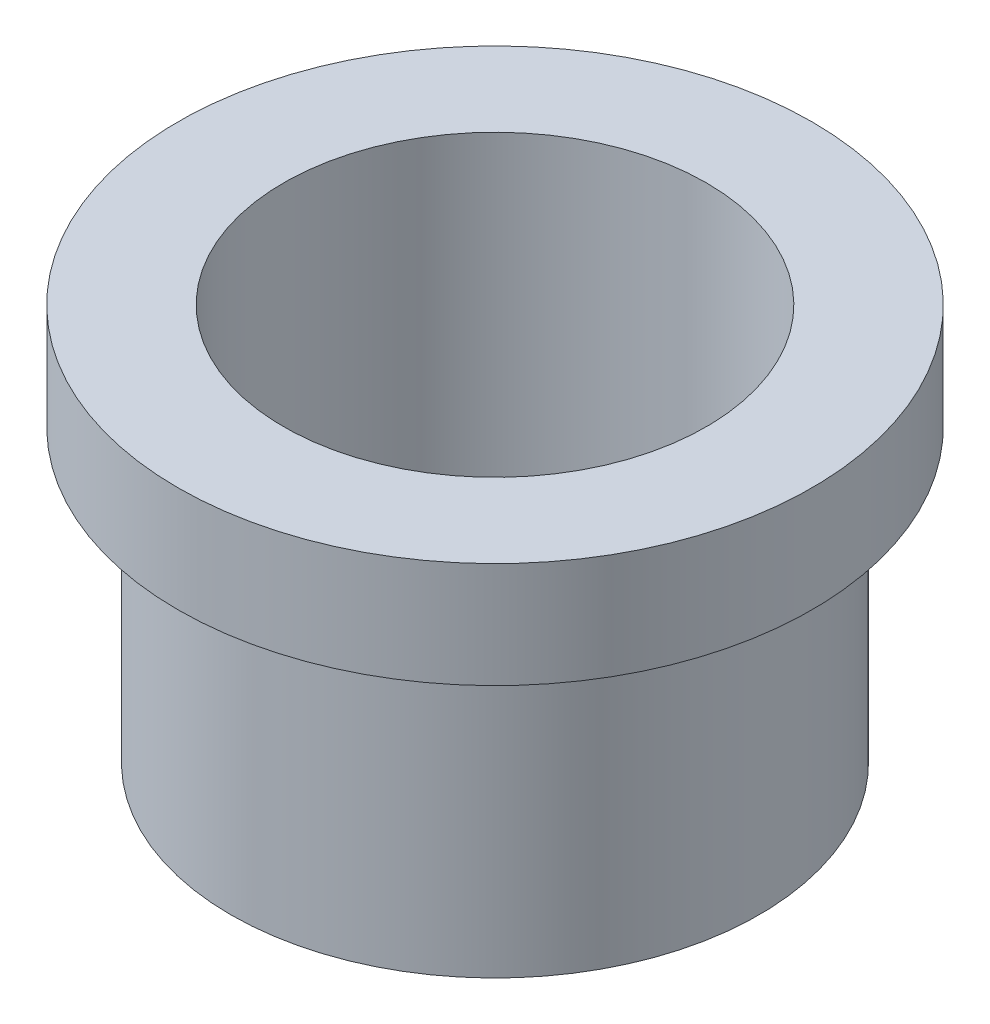
ISO-10303-21;
HEADER;
FILE_DESCRIPTION(('STEP AP214'),'2;1');
FILE_NAME('part.step','',(''),(''),'','','');
FILE_SCHEMA(('AUTOMOTIVE_DESIGN { 1 0 10303 214 1 1 1 1 }'));
ENDSEC;
DATA;
#1=APPLICATION_CONTEXT('core data for automotive mechanical design processes');
#2=APPLICATION_PROTOCOL_DEFINITION('international standard','automotive_design',2000,#1);
#3=PRODUCT_CONTEXT('',#1,'mechanical');
#4=PRODUCT('Part','Part','',(#3));
#5=PRODUCT_RELATED_PRODUCT_CATEGORY('part','',(#4));
#6=PRODUCT_DEFINITION_FORMATION('','',#4);
#7=PRODUCT_DEFINITION_CONTEXT('part definition',#1,'design');
#8=PRODUCT_DEFINITION('design','',#6,#7);
#9=PRODUCT_DEFINITION_SHAPE('','',#8);
#10=(LENGTH_UNIT() NAMED_UNIT(*) SI_UNIT(.MILLI.,.METRE.));
#11=(NAMED_UNIT(*) PLANE_ANGLE_UNIT() SI_UNIT($,.RADIAN.));
#12=(NAMED_UNIT(*) SI_UNIT($,.STERADIAN.) SOLID_ANGLE_UNIT());
#13=UNCERTAINTY_MEASURE_WITH_UNIT(LENGTH_MEASURE(1.E-05),#10,'distance_accuracy_value','');
#14=(GEOMETRIC_REPRESENTATION_CONTEXT(3) GLOBAL_UNCERTAINTY_ASSIGNED_CONTEXT((#13)) GLOBAL_UNIT_ASSIGNED_CONTEXT((#10,
#11,#12)) REPRESENTATION_CONTEXT('',''));
#15=CARTESIAN_POINT('',(0.,0.,0.));
#16=DIRECTION('',(0.,0.,1.));
#17=DIRECTION('',(1.,0.,0.));
#18=AXIS2_PLACEMENT_3D('',#15,#16,#17);
#19=CARTESIAN_POINT('',(4.7625,4.365625,0.));
#20=DIRECTION('',(0.,-1.,0.));
#21=DIRECTION('',(0.,0.,-1.));
#22=AXIS2_PLACEMENT_3D('',#19,#20,#21);
#23=PLANE('',#22);
#24=CARTESIAN_POINT('',(0.,4.365625,0.));
#25=DIRECTION('',(0.,-1.,0.));
#26=DIRECTION('',(0.,0.,-1.));
#27=AXIS2_PLACEMENT_3D('',#24,#25,#26);
#28=CIRCLE('',#27,3.96875);
#29=CARTESIAN_POINT('',(0.,4.365625,-3.96875));
#30=VERTEX_POINT('',#29);
#31=EDGE_CURVE('E18',#30,#30,#28,.T.);
#32=ORIENTED_EDGE('',*,*,#31,.F.);
#33=EDGE_LOOP('',(#32));
#34=FACE_BOUND('',#33,.T.);
#35=CARTESIAN_POINT('',(0.,4.365625,0.));
#36=DIRECTION('',(0.,-1.,0.));
#37=DIRECTION('',(0.,0.,-1.));
#38=AXIS2_PLACEMENT_3D('',#35,#36,#37);
#39=CIRCLE('',#38,4.7625);
#40=CARTESIAN_POINT('',(0.,4.365625,-4.7625));
#41=VERTEX_POINT('',#40);
#42=EDGE_CURVE('E34',#41,#41,#39,.F.);
#43=ORIENTED_EDGE('',*,*,#42,.F.);
#44=EDGE_LOOP('',(#43));
#45=FACE_BOUND('',#44,.T.);
#46=ADVANCED_FACE('F15',(#34,#45),#23,.T.);
#47=CARTESIAN_POINT('',(0.,0.,0.));
#48=DIRECTION('',(0.,-1.,0.));
#49=DIRECTION('',(0.,0.,-1.));
#50=AXIS2_PLACEMENT_3D('',#47,#48,#49);
#51=CYLINDRICAL_SURFACE('',#50,3.96875);
#52=ORIENTED_EDGE('',*,*,#31,.T.);
#53=EDGE_LOOP('',(#52));
#54=FACE_BOUND('',#53,.T.);
#55=CARTESIAN_POINT('',(0.,0.,0.));
#56=DIRECTION('',(0.,-1.,0.));
#57=DIRECTION('',(0.,0.,-1.));
#58=AXIS2_PLACEMENT_3D('',#55,#56,#57);
#59=CIRCLE('',#58,3.96875);
#60=CARTESIAN_POINT('',(0.,0.,-3.96875));
#61=VERTEX_POINT('',#60);
#62=EDGE_CURVE('E32',#61,#61,#59,.T.);
#63=ORIENTED_EDGE('',*,*,#62,.F.);
#64=EDGE_LOOP('',(#63));
#65=FACE_BOUND('',#64,.T.);
#66=ADVANCED_FACE('F41',(#54,#65),#51,.T.);
#67=CARTESIAN_POINT('',(0.,0.,0.));
#68=DIRECTION('',(0.,-1.,0.));
#69=DIRECTION('',(0.,0.,-1.));
#70=AXIS2_PLACEMENT_3D('',#67,#68,#69);
#71=CYLINDRICAL_SURFACE('',#70,4.7625);
#72=CARTESIAN_POINT('',(0.,5.953125,0.));
#73=DIRECTION('',(0.,-1.,0.));
#74=DIRECTION('',(0.,0.,-1.));
#75=AXIS2_PLACEMENT_3D('',#72,#73,#74);
#76=CIRCLE('',#75,4.7625);
#77=CARTESIAN_POINT('',(0.,5.953125,-4.7625));
#78=VERTEX_POINT('',#77);
#79=EDGE_CURVE('E27',#78,#78,#76,.F.);
#80=ORIENTED_EDGE('',*,*,#79,.F.);
#81=EDGE_LOOP('',(#80));
#82=FACE_BOUND('',#81,.T.);
#83=ORIENTED_EDGE('',*,*,#42,.T.);
#84=EDGE_LOOP('',(#83));
#85=FACE_BOUND('',#84,.T.);
#86=ADVANCED_FACE('F50',(#82,#85),#71,.T.);
#87=CARTESIAN_POINT('',(3.96875,0.,0.));
#88=DIRECTION('',(0.,-1.,0.));
#89=DIRECTION('',(0.,0.,-1.));
#90=AXIS2_PLACEMENT_3D('',#87,#88,#89);
#91=PLANE('',#90);
#92=CARTESIAN_POINT('',(0.,0.,0.));
#93=DIRECTION('',(0.,-1.,0.));
#94=DIRECTION('',(0.,0.,-1.));
#95=AXIS2_PLACEMENT_3D('',#92,#93,#94);
#96=CIRCLE('',#95,3.175);
#97=CARTESIAN_POINT('',(0.,0.,-3.175));
#98=VERTEX_POINT('',#97);
#99=EDGE_CURVE('E22',#98,#98,#96,.F.);
#100=ORIENTED_EDGE('',*,*,#99,.T.);
#101=EDGE_LOOP('',(#100));
#102=FACE_BOUND('',#101,.T.);
#103=ORIENTED_EDGE('',*,*,#62,.T.);
#104=EDGE_LOOP('',(#103));
#105=FACE_BOUND('',#104,.T.);
#106=ADVANCED_FACE('F59',(#102,#105),#91,.T.);
#107=CARTESIAN_POINT('',(3.175,5.953125,0.));
#108=DIRECTION('',(0.,1.,0.));
#109=DIRECTION('',(0.,0.,1.));
#110=AXIS2_PLACEMENT_3D('',#107,#108,#109);
#111=PLANE('',#110);
#112=ORIENTED_EDGE('',*,*,#79,.T.);
#113=EDGE_LOOP('',(#112));
#114=FACE_BOUND('',#113,.T.);
#115=CARTESIAN_POINT('',(0.,5.953125,0.));
#116=DIRECTION('',(0.,-1.,0.));
#117=DIRECTION('',(0.,0.,-1.));
#118=AXIS2_PLACEMENT_3D('',#115,#116,#117);
#119=CIRCLE('',#118,3.175);
#120=CARTESIAN_POINT('',(0.,5.953125,-3.175));
#121=VERTEX_POINT('',#120);
#122=EDGE_CURVE('E10',#121,#121,#119,.T.);
#123=ORIENTED_EDGE('',*,*,#122,.T.);
#124=EDGE_LOOP('',(#123));
#125=FACE_BOUND('',#124,.T.);
#126=ADVANCED_FACE('F53',(#114,#125),#111,.T.);
#127=CARTESIAN_POINT('',(0.,0.,0.));
#128=DIRECTION('',(0.,-1.,0.));
#129=DIRECTION('',(0.,0.,-1.));
#130=AXIS2_PLACEMENT_3D('',#127,#128,#129);
#131=CYLINDRICAL_SURFACE('',#130,3.175);
#132=ORIENTED_EDGE('',*,*,#99,.F.);
#133=EDGE_LOOP('',(#132));
#134=FACE_BOUND('',#133,.T.);
#135=ORIENTED_EDGE('',*,*,#122,.F.);
#136=EDGE_LOOP('',(#135));
#137=FACE_BOUND('',#136,.T.);
#138=ADVANCED_FACE('F51',(#134,#137),#131,.F.);
#139=CLOSED_SHELL('',(#46,#66,#86,#106,#126,#138));
#140=MANIFOLD_SOLID_BREP('B1',#139);
#141=ADVANCED_BREP_SHAPE_REPRESENTATION('',(#18,#140),#14);
#142=SHAPE_DEFINITION_REPRESENTATION(#9,#141);
ENDSEC;
END-ISO-10303-21;
